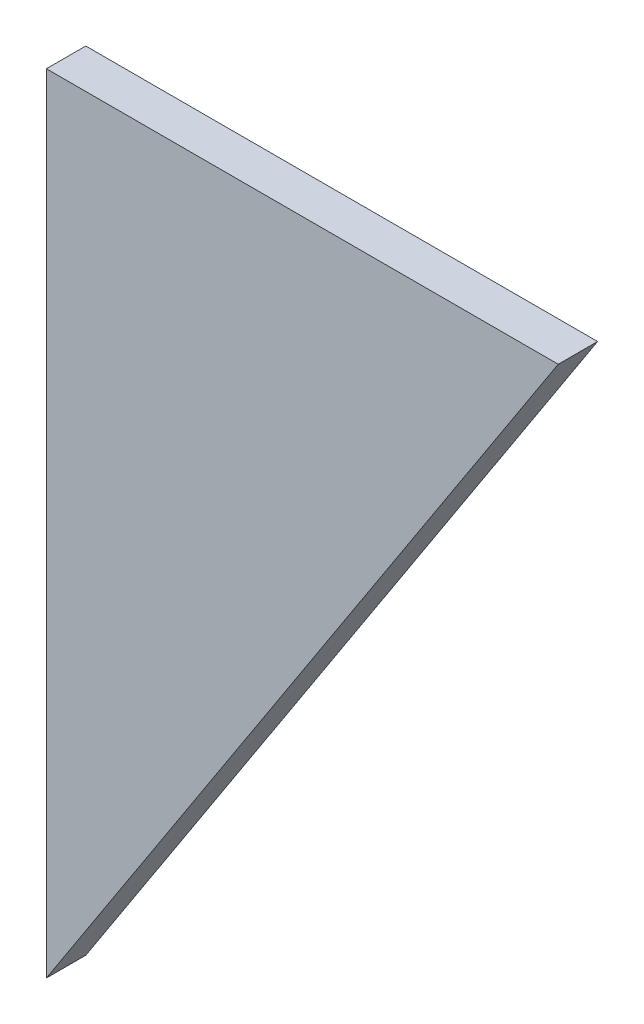
ISO-10303-21;
HEADER;
FILE_DESCRIPTION(('STEP AP214'),'2;1');
FILE_NAME('part.step','',(''),(''),'','','');
FILE_SCHEMA(('AUTOMOTIVE_DESIGN { 1 0 10303 214 1 1 1 1 }'));
ENDSEC;
DATA;
#1=APPLICATION_CONTEXT('core data for automotive mechanical design processes');
#2=APPLICATION_PROTOCOL_DEFINITION('international standard','automotive_design',2000,#1);
#3=PRODUCT_CONTEXT('',#1,'mechanical');
#4=PRODUCT('Part','Part','',(#3));
#5=PRODUCT_RELATED_PRODUCT_CATEGORY('part','',(#4));
#6=PRODUCT_DEFINITION_FORMATION('','',#4);
#7=PRODUCT_DEFINITION_CONTEXT('part definition',#1,'design');
#8=PRODUCT_DEFINITION('design','',#6,#7);
#9=PRODUCT_DEFINITION_SHAPE('','',#8);
#10=(LENGTH_UNIT() NAMED_UNIT(*) SI_UNIT(.MILLI.,.METRE.));
#11=(NAMED_UNIT(*) PLANE_ANGLE_UNIT() SI_UNIT($,.RADIAN.));
#12=(NAMED_UNIT(*) SI_UNIT($,.STERADIAN.) SOLID_ANGLE_UNIT());
#13=UNCERTAINTY_MEASURE_WITH_UNIT(LENGTH_MEASURE(1.E-05),#10,'distance_accuracy_value','');
#14=(GEOMETRIC_REPRESENTATION_CONTEXT(3) GLOBAL_UNCERTAINTY_ASSIGNED_CONTEXT((#13)) GLOBAL_UNIT_ASSIGNED_CONTEXT((#10,
#11,#12)) REPRESENTATION_CONTEXT('',''));
#15=CARTESIAN_POINT('',(0.,0.,0.));
#16=DIRECTION('',(0.,0.,1.));
#17=DIRECTION('',(1.,0.,0.));
#18=AXIS2_PLACEMENT_3D('',#15,#16,#17);
#19=CARTESIAN_POINT('',(-65.0000000000001,-100.,10.));
#20=DIRECTION('',(-0.838443616300637,0.544988350595414,0.));
#21=DIRECTION('',(-0.544988350595414,-0.838443616300637,0.));
#22=AXIS2_PLACEMENT_3D('',#19,#20,#21);
#23=PLANE('',#22);
#24=DIRECTION('',(0.544988350595414,0.838443616300637,0.));
#25=VECTOR('',#24,1.);
#26=CARTESIAN_POINT('',(-65.0000000000001,-100.,0.));
#27=LINE('',#26,#25);
#28=CARTESIAN_POINT('',(-65.0000000000001,-100.,0.));
#29=VERTEX_POINT('',#28);
#30=CARTESIAN_POINT('',(64.9999999999999,100.,0.));
#31=VERTEX_POINT('',#30);
#32=EDGE_CURVE('E89',#29,#31,#27,.T.);
#33=ORIENTED_EDGE('',*,*,#32,.T.);
#34=DIRECTION('',(0.,0.,-1.));
#35=VECTOR('',#34,1.);
#36=CARTESIAN_POINT('',(64.9999999999999,100.,10.));
#37=LINE('',#36,#35);
#38=CARTESIAN_POINT('',(64.9999999999999,100.,10.));
#39=VERTEX_POINT('',#38);
#40=EDGE_CURVE('E11',#39,#31,#37,.T.);
#41=ORIENTED_EDGE('',*,*,#40,.F.);
#42=DIRECTION('',(0.544988350595414,0.838443616300637,0.));
#43=VECTOR('',#42,1.);
#44=CARTESIAN_POINT('',(-65.0000000000001,-100.,10.));
#45=LINE('',#44,#43);
#46=CARTESIAN_POINT('',(-65.0000000000001,-100.,10.));
#47=VERTEX_POINT('',#46);
#48=EDGE_CURVE('E81',#47,#39,#45,.T.);
#49=ORIENTED_EDGE('',*,*,#48,.F.);
#50=DIRECTION('',(0.,0.,-1.));
#51=VECTOR('',#50,1.);
#52=CARTESIAN_POINT('',(-65.0000000000001,-100.,10.));
#53=LINE('',#52,#51);
#54=EDGE_CURVE('E90',#47,#29,#53,.T.);
#55=ORIENTED_EDGE('',*,*,#54,.T.);
#56=EDGE_LOOP('',(#33,#41,#49,#55));
#57=FACE_BOUND('',#56,.T.);
#58=ADVANCED_FACE('F39',(#57),#23,.F.);
#59=CARTESIAN_POINT('',(64.9999999999999,100.,10.));
#60=DIRECTION('',(0.,-1.,0.));
#61=DIRECTION('',(0.,0.,-1.));
#62=AXIS2_PLACEMENT_3D('',#59,#60,#61);
#63=PLANE('',#62);
#64=DIRECTION('',(-1.,0.,0.));
#65=VECTOR('',#64,1.);
#66=CARTESIAN_POINT('',(64.9999999999999,100.,0.));
#67=LINE('',#66,#65);
#68=CARTESIAN_POINT('',(-65.0000000000001,100.,0.));
#69=VERTEX_POINT('',#68);
#70=EDGE_CURVE('E68',#31,#69,#67,.T.);
#71=ORIENTED_EDGE('',*,*,#70,.T.);
#72=DIRECTION('',(0.,0.,-1.));
#73=VECTOR('',#72,1.);
#74=CARTESIAN_POINT('',(-65.0000000000001,100.,10.));
#75=LINE('',#74,#73);
#76=CARTESIAN_POINT('',(-65.0000000000001,100.,10.));
#77=VERTEX_POINT('',#76);
#78=EDGE_CURVE('E48',#77,#69,#75,.T.);
#79=ORIENTED_EDGE('',*,*,#78,.F.);
#80=DIRECTION('',(-1.,0.,0.));
#81=VECTOR('',#80,1.);
#82=CARTESIAN_POINT('',(64.9999999999999,100.,10.));
#83=LINE('',#82,#81);
#84=EDGE_CURVE('E76',#39,#77,#83,.T.);
#85=ORIENTED_EDGE('',*,*,#84,.F.);
#86=ORIENTED_EDGE('',*,*,#40,.T.);
#87=EDGE_LOOP('',(#71,#79,#85,#86));
#88=FACE_BOUND('',#87,.T.);
#89=ADVANCED_FACE('F77',(#88),#63,.F.);
#90=CARTESIAN_POINT('',(-65.0000000000001,-100.,10.));
#91=DIRECTION('',(1.,0.,0.));
#92=DIRECTION('',(0.,0.,-1.));
#93=AXIS2_PLACEMENT_3D('',#90,#91,#92);
#94=PLANE('',#93);
#95=DIRECTION('',(0.,-1.,0.));
#96=VECTOR('',#95,1.);
#97=CARTESIAN_POINT('',(-65.0000000000001,-100.,0.));
#98=LINE('',#97,#96);
#99=EDGE_CURVE('E73',#69,#29,#98,.T.);
#100=ORIENTED_EDGE('',*,*,#99,.T.);
#101=ORIENTED_EDGE('',*,*,#54,.F.);
#102=DIRECTION('',(0.,-1.,0.));
#103=VECTOR('',#102,1.);
#104=CARTESIAN_POINT('',(-65.0000000000001,-100.,10.));
#105=LINE('',#104,#103);
#106=EDGE_CURVE('E56',#77,#47,#105,.T.);
#107=ORIENTED_EDGE('',*,*,#106,.F.);
#108=ORIENTED_EDGE('',*,*,#78,.T.);
#109=EDGE_LOOP('',(#100,#101,#107,#108));
#110=FACE_BOUND('',#109,.T.);
#111=ADVANCED_FACE('F102',(#110),#94,.F.);
#112=CARTESIAN_POINT('',(0.,0.,10.));
#113=DIRECTION('',(0.,0.,1.));
#114=DIRECTION('',(1.,0.,0.));
#115=AXIS2_PLACEMENT_3D('',#112,#113,#114);
#116=PLANE('',#115);
#117=ORIENTED_EDGE('',*,*,#48,.T.);
#118=ORIENTED_EDGE('',*,*,#84,.T.);
#119=ORIENTED_EDGE('',*,*,#106,.T.);
#120=EDGE_LOOP('',(#117,#118,#119));
#121=FACE_BOUND('',#120,.T.);
#122=ADVANCED_FACE('F84',(#121),#116,.T.);
#123=CARTESIAN_POINT('',(0.,0.,0.));
#124=DIRECTION('',(0.,0.,1.));
#125=DIRECTION('',(1.,0.,0.));
#126=AXIS2_PLACEMENT_3D('',#123,#124,#125);
#127=PLANE('',#126);
#128=ORIENTED_EDGE('',*,*,#32,.F.);
#129=ORIENTED_EDGE('',*,*,#99,.F.);
#130=ORIENTED_EDGE('',*,*,#70,.F.);
#131=EDGE_LOOP('',(#128,#129,#130));
#132=FACE_BOUND('',#131,.T.);
#133=ADVANCED_FACE('F103',(#132),#127,.F.);
#134=CLOSED_SHELL('',(#58,#89,#111,#122,#133));
#135=MANIFOLD_SOLID_BREP('B2',#134);
#136=ADVANCED_BREP_SHAPE_REPRESENTATION('',(#18,#135),#14);
#137=SHAPE_DEFINITION_REPRESENTATION(#9,#136);
ENDSEC;
END-ISO-10303-21;
